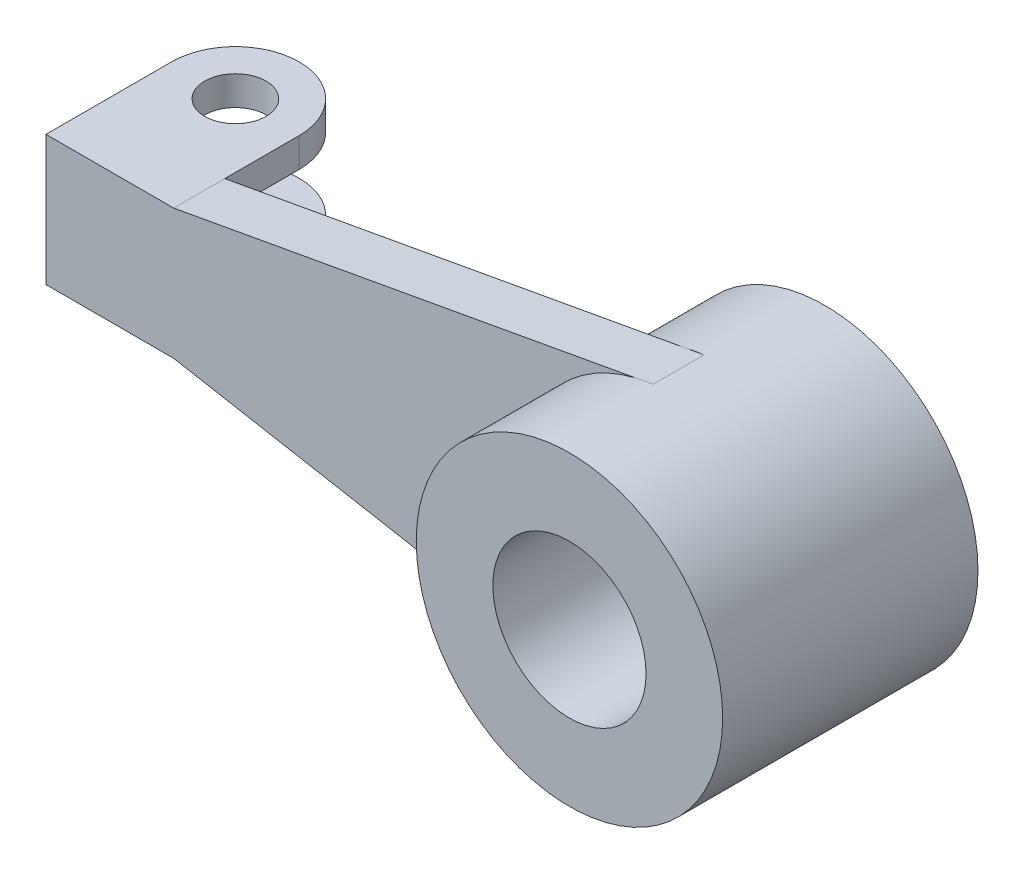
ISO-10303-21;
HEADER;
FILE_DESCRIPTION(('STEP AP214'),'2;1');
FILE_NAME('part.step','',(''),(''),'','','');
FILE_SCHEMA(('AUTOMOTIVE_DESIGN { 1 0 10303 214 1 1 1 1 }'));
ENDSEC;
DATA;
#1=APPLICATION_CONTEXT('core data for automotive mechanical design processes');
#2=APPLICATION_PROTOCOL_DEFINITION('international standard','automotive_design',2000,#1);
#3=PRODUCT_CONTEXT('',#1,'mechanical');
#4=PRODUCT('Part','Part','',(#3));
#5=PRODUCT_RELATED_PRODUCT_CATEGORY('part','',(#4));
#6=PRODUCT_DEFINITION_FORMATION('','',#4);
#7=PRODUCT_DEFINITION_CONTEXT('part definition',#1,'design');
#8=PRODUCT_DEFINITION('design','',#6,#7);
#9=PRODUCT_DEFINITION_SHAPE('','',#8);
#10=(LENGTH_UNIT() NAMED_UNIT(*) SI_UNIT(.MILLI.,.METRE.));
#11=(NAMED_UNIT(*) PLANE_ANGLE_UNIT() SI_UNIT($,.RADIAN.));
#12=(NAMED_UNIT(*) SI_UNIT($,.STERADIAN.) SOLID_ANGLE_UNIT());
#13=UNCERTAINTY_MEASURE_WITH_UNIT(LENGTH_MEASURE(1.E-05),#10,'distance_accuracy_value','');
#14=(GEOMETRIC_REPRESENTATION_CONTEXT(3) GLOBAL_UNCERTAINTY_ASSIGNED_CONTEXT((#13)) GLOBAL_UNIT_ASSIGNED_CONTEXT((#10,
#11,#12)) REPRESENTATION_CONTEXT('',''));
#15=CARTESIAN_POINT('',(0.,0.,0.));
#16=DIRECTION('',(0.,0.,1.));
#17=DIRECTION('',(1.,0.,0.));
#18=AXIS2_PLACEMENT_3D('',#15,#16,#17);
#19=CARTESIAN_POINT('',(-70.2054794520546,0.,25.));
#20=DIRECTION('',(1.,0.,0.));
#21=DIRECTION('',(0.,0.,-1.));
#22=AXIS2_PLACEMENT_3D('',#19,#20,#21);
#23=PLANE('',#22);
#24=DIRECTION('',(0.,0.,1.));
#25=VECTOR('',#24,1.);
#26=CARTESIAN_POINT('',(-70.2054794520546,70.,0.));
#27=LINE('',#26,#25);
#28=CARTESIAN_POINT('',(-70.2054794520546,70.,-220.864440970832));
#29=VERTEX_POINT('',#28);
#30=CARTESIAN_POINT('',(-70.2054794520546,70.,-75.));
#31=VERTEX_POINT('',#30);
#32=EDGE_CURVE('E157',#29,#31,#27,.T.);
#33=ORIENTED_EDGE('',*,*,#32,.T.);
#34=DIRECTION('',(0.,1.,0.));
#35=VECTOR('',#34,1.);
#36=CARTESIAN_POINT('',(-70.2054794520546,0.,-75.));
#37=LINE('',#36,#35);
#38=CARTESIAN_POINT('',(-70.2054794520546,-70.,-75.));
#39=VERTEX_POINT('',#38);
#40=EDGE_CURVE('E145',#39,#31,#37,.T.);
#41=ORIENTED_EDGE('',*,*,#40,.F.);
#42=DIRECTION('',(0.,0.,1.));
#43=VECTOR('',#42,1.);
#44=CARTESIAN_POINT('',(-70.2054794520546,-70.,0.));
#45=LINE('',#44,#43);
#46=CARTESIAN_POINT('',(-70.2054794520546,-70.,-220.864440970832));
#47=VERTEX_POINT('',#46);
#48=EDGE_CURVE('E151',#47,#39,#45,.T.);
#49=ORIENTED_EDGE('',*,*,#48,.F.);
#50=DIRECTION('',(0.,1.,0.));
#51=VECTOR('',#50,1.);
#52=CARTESIAN_POINT('',(-70.2054794520546,-126.792423142735,-220.864440970832));
#53=LINE('',#52,#51);
#54=CARTESIAN_POINT('',(-70.2054794520546,-126.792423142735,-220.864440970832));
#55=VERTEX_POINT('',#54);
#56=EDGE_CURVE('E199',#55,#47,#53,.T.);
#57=ORIENTED_EDGE('',*,*,#56,.F.);
#58=DIRECTION('',(0.,0.,-1.));
#59=VECTOR('',#58,1.);
#60=CARTESIAN_POINT('',(-70.2054794520546,-126.792423142735,0.));
#61=LINE('',#60,#59);
#62=CARTESIAN_POINT('',(-70.2054794520546,-126.792423142735,-75.));
#63=VERTEX_POINT('',#62);
#64=EDGE_CURVE('E185',#63,#55,#61,.T.);
#65=ORIENTED_EDGE('',*,*,#64,.F.);
#66=DIRECTION('',(0.,-1.,0.));
#67=VECTOR('',#66,1.);
#68=CARTESIAN_POINT('',(-70.2054794520546,0.,-75.));
#69=LINE('',#68,#67);
#70=CARTESIAN_POINT('',(-70.2054794520546,-127.397260273972,-75.));
#71=VERTEX_POINT('',#70);
#72=EDGE_CURVE('E231',#63,#71,#69,.T.);
#73=ORIENTED_EDGE('',*,*,#72,.T.);
#74=DIRECTION('',(0.,0.,-1.));
#75=VECTOR('',#74,1.);
#76=CARTESIAN_POINT('',(-70.2054794520546,-127.397260273972,25.));
#77=LINE('',#76,#75);
#78=CARTESIAN_POINT('',(-70.2054794520546,-127.397260273972,25.));
#79=VERTEX_POINT('',#78);
#80=EDGE_CURVE('E282',#79,#71,#77,.T.);
#81=ORIENTED_EDGE('',*,*,#80,.F.);
#82=DIRECTION('',(0.,-1.,0.));
#83=VECTOR('',#82,1.);
#84=CARTESIAN_POINT('',(-70.2054794520546,0.,25.));
#85=LINE('',#84,#83);
#86=CARTESIAN_POINT('',(-70.2054794520546,127.397260273972,25.));
#87=VERTEX_POINT('',#86);
#88=EDGE_CURVE('E276',#87,#79,#85,.T.);
#89=ORIENTED_EDGE('',*,*,#88,.F.);
#90=DIRECTION('',(0.,0.,-1.));
#91=VECTOR('',#90,1.);
#92=CARTESIAN_POINT('',(-70.2054794520546,127.397260273972,25.));
#93=LINE('',#92,#91);
#94=CARTESIAN_POINT('',(-70.2054794520546,127.397260273972,-220.864440970832));
#95=VERTEX_POINT('',#94);
#96=EDGE_CURVE('E284',#87,#95,#93,.T.);
#97=ORIENTED_EDGE('',*,*,#96,.T.);
#98=EDGE_CURVE('E201',#29,#95,#53,.T.);
#99=ORIENTED_EDGE('',*,*,#98,.F.);
#100=EDGE_LOOP('',(#33,#41,#49,#57,#65,#73,#81,#89,#97,#99));
#101=FACE_BOUND('',#100,.T.);
#102=ADVANCED_FACE('F35',(#101),#23,.F.);
#103=CARTESIAN_POINT('',(179.794520547945,-126.792423142735,0.));
#104=DIRECTION('',(1.,0.,0.));
#105=DIRECTION('',(0.,0.,-1.));
#106=AXIS2_PLACEMENT_3D('',#103,#104,#105);
#107=PLANE('',#106);
#108=DIRECTION('',(0.,1.,0.));
#109=VECTOR('',#108,1.);
#110=CARTESIAN_POINT('',(179.794520547945,-126.792423142735,-75.));
#111=LINE('',#110,#109);
#112=CARTESIAN_POINT('',(179.794520547945,70.,-75.));
#113=VERTEX_POINT('',#112);
#114=CARTESIAN_POINT('',(179.794520547945,127.397260273972,-75.));
#115=VERTEX_POINT('',#114);
#116=EDGE_CURVE('E198',#113,#115,#111,.T.);
#117=ORIENTED_EDGE('',*,*,#116,.F.);
#118=DIRECTION('',(0.,0.,-1.));
#119=VECTOR('',#118,1.);
#120=CARTESIAN_POINT('',(179.794520547945,70.,0.));
#121=LINE('',#120,#119);
#122=CARTESIAN_POINT('',(179.794520547945,70.,-220.864440970832));
#123=VERTEX_POINT('',#122);
#124=EDGE_CURVE('E168',#113,#123,#121,.T.);
#125=ORIENTED_EDGE('',*,*,#124,.T.);
#126=DIRECTION('',(0.,1.,0.));
#127=VECTOR('',#126,1.);
#128=CARTESIAN_POINT('',(179.794520547945,-126.792423142735,-220.864440970832));
#129=LINE('',#128,#127);
#130=CARTESIAN_POINT('',(179.794520547945,127.397260273972,-220.864440970832));
#131=VERTEX_POINT('',#130);
#132=EDGE_CURVE('E188',#123,#131,#129,.T.);
#133=ORIENTED_EDGE('',*,*,#132,.T.);
#134=DIRECTION('',(0.,0.,-1.));
#135=VECTOR('',#134,1.);
#136=CARTESIAN_POINT('',(179.794520547945,127.397260273972,0.));
#137=LINE('',#136,#135);
#138=EDGE_CURVE('E191',#115,#131,#137,.T.);
#139=ORIENTED_EDGE('',*,*,#138,.F.);
#140=EDGE_LOOP('',(#117,#125,#133,#139));
#141=FACE_BOUND('',#140,.T.);
#142=ADVANCED_FACE('F302',(#141),#107,.T.);
#143=CARTESIAN_POINT('',(54.7945205479454,-126.792423142735,-220.864440970832));
#144=DIRECTION('',(0.,1.,0.));
#145=DIRECTION('',(0.,0.,1.));
#146=AXIS2_PLACEMENT_3D('',#143,#144,#145);
#147=CYLINDRICAL_SURFACE('',#146,60.);
#148=CARTESIAN_POINT('',(54.7945205479454,127.397260273972,-220.864440970832));
#149=DIRECTION('',(0.,1.,0.));
#150=DIRECTION('',(0.,0.,1.));
#151=AXIS2_PLACEMENT_3D('',#148,#149,#150);
#152=CIRCLE('',#151,60.);
#153=CARTESIAN_POINT('',(54.7945205479454,127.397260273972,-160.864440970832));
#154=VERTEX_POINT('',#153);
#155=EDGE_CURVE('E174',#154,#154,#152,.T.);
#156=ORIENTED_EDGE('',*,*,#155,.T.);
#157=EDGE_LOOP('',(#156));
#158=FACE_BOUND('',#157,.T.);
#159=CARTESIAN_POINT('',(54.7945205479454,70.,-220.864440970832));
#160=DIRECTION('',(0.,-1.,0.));
#161=DIRECTION('',(0.,0.,-1.));
#162=AXIS2_PLACEMENT_3D('',#159,#160,#161);
#163=CIRCLE('',#162,60.);
#164=CARTESIAN_POINT('',(54.7945205479454,70.,-280.864440970832));
#165=VERTEX_POINT('',#164);
#166=EDGE_CURVE('E171',#165,#165,#163,.F.);
#167=ORIENTED_EDGE('',*,*,#166,.F.);
#168=EDGE_LOOP('',(#167));
#169=FACE_BOUND('',#168,.T.);
#170=ADVANCED_FACE('F347',(#158,#169),#147,.F.);
#171=CARTESIAN_POINT('',(54.7945205479454,-126.792423142735,-220.864440970832));
#172=DIRECTION('',(0.,1.,0.));
#173=DIRECTION('',(0.,0.,1.));
#174=AXIS2_PLACEMENT_3D('',#171,#172,#173);
#175=CYLINDRICAL_SURFACE('',#174,125.);
#176=ORIENTED_EDGE('',*,*,#132,.F.);
#177=CARTESIAN_POINT('',(54.7945205479454,70.,-220.864440970832));
#178=DIRECTION('',(0.,-1.,0.));
#179=DIRECTION('',(0.,0.,-1.));
#180=AXIS2_PLACEMENT_3D('',#177,#178,#179);
#181=CIRCLE('',#180,125.);
#182=EDGE_CURVE('E11',#123,#29,#181,.F.);
#183=ORIENTED_EDGE('',*,*,#182,.T.);
#184=ORIENTED_EDGE('',*,*,#98,.T.);
#185=CARTESIAN_POINT('',(54.7945205479454,127.397260273972,-220.864440970832));
#186=DIRECTION('',(0.,1.,0.));
#187=DIRECTION('',(0.,0.,1.));
#188=AXIS2_PLACEMENT_3D('',#185,#186,#187);
#189=CIRCLE('',#188,125.);
#190=EDGE_CURVE('E179',#131,#95,#189,.T.);
#191=ORIENTED_EDGE('',*,*,#190,.F.);
#192=EDGE_LOOP('',(#176,#183,#184,#191));
#193=FACE_BOUND('',#192,.T.);
#194=ADVANCED_FACE('F306',(#193),#175,.T.);
#195=CARTESIAN_POINT('',(0.,0.,-75.));
#196=DIRECTION('',(0.,0.,-1.));
#197=DIRECTION('',(1.,0.,0.));
#198=AXIS2_PLACEMENT_3D('',#195,#196,#197);
#199=PLANE('',#198);
#200=DIRECTION('',(-1.,0.,0.));
#201=VECTOR('',#200,1.);
#202=CARTESIAN_POINT('',(229.794520547945,70.,-75.));
#203=LINE('',#202,#201);
#204=EDGE_CURVE('E148',#113,#31,#203,.T.);
#205=ORIENTED_EDGE('',*,*,#204,.F.);
#206=ORIENTED_EDGE('',*,*,#116,.T.);
#207=DIRECTION('',(0.983919626816122,0.178611780031506,0.));
#208=VECTOR('',#207,1.);
#209=CARTESIAN_POINT('',(-16.652913148138,91.7359878907598,-75.));
#210=LINE('',#209,#208);
#211=CARTESIAN_POINT('',(1084.18392790381,291.57185084717,-75.));
#212=VERTEX_POINT('',#211);
#213=EDGE_CURVE('E230',#115,#212,#210,.T.);
#214=ORIENTED_EDGE('',*,*,#213,.T.);
#215=CARTESIAN_POINT('',(1154.79452054795,0.,-75.));
#216=DIRECTION('',(0.,0.,1.));
#217=DIRECTION('',(1.,0.,0.));
#218=AXIS2_PLACEMENT_3D('',#215,#216,#217);
#219=CIRCLE('',#218,300.);
#220=CARTESIAN_POINT('',(1084.18392790381,-291.57185084717,-75.));
#221=VERTEX_POINT('',#220);
#222=EDGE_CURVE('E217',#212,#221,#219,.T.);
#223=ORIENTED_EDGE('',*,*,#222,.T.);
#224=DIRECTION('',(0.983919626816122,-0.178611780031506,0.));
#225=VECTOR('',#224,1.);
#226=CARTESIAN_POINT('',(-16.652913148138,-91.7359878907598,-75.));
#227=LINE('',#226,#225);
#228=CARTESIAN_POINT('',(179.794520547945,-127.397260273972,-75.));
#229=VERTEX_POINT('',#228);
#230=EDGE_CURVE('E367',#229,#221,#227,.T.);
#231=ORIENTED_EDGE('',*,*,#230,.F.);
#232=DIRECTION('',(1.,0.,0.));
#233=VECTOR('',#232,1.);
#234=CARTESIAN_POINT('',(0.,-127.397260273972,-75.));
#235=LINE('',#234,#233);
#236=EDGE_CURVE('E372',#71,#229,#235,.T.);
#237=ORIENTED_EDGE('',*,*,#236,.F.);
#238=ORIENTED_EDGE('',*,*,#72,.F.);
#239=DIRECTION('',(-1.,0.,0.));
#240=VECTOR('',#239,1.);
#241=CARTESIAN_POINT('',(0.,-126.792423142735,-75.));
#242=LINE('',#241,#240);
#243=CARTESIAN_POINT('',(179.794520547945,-126.792423142735,-75.));
#244=VERTEX_POINT('',#243);
#245=EDGE_CURVE('E58',#244,#63,#242,.T.);
#246=ORIENTED_EDGE('',*,*,#245,.F.);
#247=CARTESIAN_POINT('',(179.794520547945,-70.,-75.));
#248=VERTEX_POINT('',#247);
#249=EDGE_CURVE('E147',#244,#248,#111,.T.);
#250=ORIENTED_EDGE('',*,*,#249,.T.);
#251=DIRECTION('',(-1.,0.,0.));
#252=VECTOR('',#251,1.);
#253=CARTESIAN_POINT('',(229.794520547945,-70.,-75.));
#254=LINE('',#253,#252);
#255=EDGE_CURVE('E140',#248,#39,#254,.T.);
#256=ORIENTED_EDGE('',*,*,#255,.T.);
#257=ORIENTED_EDGE('',*,*,#40,.T.);
#258=EDGE_LOOP('',(#205,#206,#214,#223,#231,#237,#238,#246,#250,#256,#257));
#259=FACE_BOUND('',#258,.T.);
#260=ADVANCED_FACE('F143',(#259),#199,.T.);
#261=CARTESIAN_POINT('',(-16.652913148138,-91.7359878907598,25.));
#262=DIRECTION('',(0.178611780031506,0.983919626816122,0.));
#263=DIRECTION('',(-0.983919626816122,0.178611780031506,0.));
#264=AXIS2_PLACEMENT_3D('',#261,#262,#263);
#265=PLANE('',#264);
#266=DIRECTION('',(0.,0.,-1.));
#267=VECTOR('',#266,1.);
#268=CARTESIAN_POINT('',(179.794520547945,-127.397260273972,25.));
#269=LINE('',#268,#267);
#270=CARTESIAN_POINT('',(179.794520547945,-127.397260273972,25.));
#271=VERTEX_POINT('',#270);
#272=EDGE_CURVE('E280',#271,#229,#269,.T.);
#273=ORIENTED_EDGE('',*,*,#272,.T.);
#274=ORIENTED_EDGE('',*,*,#230,.T.);
#275=CARTESIAN_POINT('',(1118.41838937427,-297.786462218879,-75.));
#276=VERTEX_POINT('',#275);
#277=EDGE_CURVE('E211',#221,#276,#227,.T.);
#278=ORIENTED_EDGE('',*,*,#277,.T.);
#279=DIRECTION('',(0.,0.,-1.));
#280=VECTOR('',#279,1.);
#281=CARTESIAN_POINT('',(1118.41838937427,-297.786462218879,25.));
#282=LINE('',#281,#280);
#283=CARTESIAN_POINT('',(1118.41838937427,-297.786462218879,25.));
#284=VERTEX_POINT('',#283);
#285=EDGE_CURVE('E254',#284,#276,#282,.T.);
#286=ORIENTED_EDGE('',*,*,#285,.F.);
#287=DIRECTION('',(0.983919626816122,-0.178611780031506,0.));
#288=VECTOR('',#287,1.);
#289=CARTESIAN_POINT('',(-16.652913148138,-91.7359878907598,25.));
#290=LINE('',#289,#288);
#291=CARTESIAN_POINT('',(1084.18392790381,-291.57185084717,25.));
#292=VERTEX_POINT('',#291);
#293=EDGE_CURVE('E244',#292,#284,#290,.T.);
#294=ORIENTED_EDGE('',*,*,#293,.F.);
#295=EDGE_CURVE('E268',#271,#292,#290,.T.);
#296=ORIENTED_EDGE('',*,*,#295,.F.);
#297=EDGE_LOOP('',(#273,#274,#278,#286,#294,#296));
#298=FACE_BOUND('',#297,.T.);
#299=ADVANCED_FACE('F358',(#298),#265,.F.);
#300=CARTESIAN_POINT('',(1154.79452054795,0.,25.));
#301=DIRECTION('',(0.,0.,-1.));
#302=DIRECTION('',(-1.,0.,0.));
#303=AXIS2_PLACEMENT_3D('',#300,#301,#302);
#304=CYLINDRICAL_SURFACE('',#303,300.);
#305=ORIENTED_EDGE('',*,*,#285,.T.);
#306=EDGE_CURVE('E207',#221,#276,#219,.T.);
#307=ORIENTED_EDGE('',*,*,#306,.F.);
#308=ORIENTED_EDGE('',*,*,#222,.F.);
#309=CARTESIAN_POINT('',(1118.41838937427,297.786462218879,-75.));
#310=VERTEX_POINT('',#309);
#311=EDGE_CURVE('E212',#310,#212,#219,.T.);
#312=ORIENTED_EDGE('',*,*,#311,.F.);
#313=DIRECTION('',(0.,0.,-1.));
#314=VECTOR('',#313,1.);
#315=CARTESIAN_POINT('',(1118.41838937427,297.786462218879,25.));
#316=LINE('',#315,#314);
#317=CARTESIAN_POINT('',(1118.41838937427,297.786462218879,25.));
#318=VERTEX_POINT('',#317);
#319=EDGE_CURVE('E257',#318,#310,#316,.T.);
#320=ORIENTED_EDGE('',*,*,#319,.F.);
#321=CARTESIAN_POINT('',(1154.79452054795,0.,25.));
#322=DIRECTION('',(0.,0.,1.));
#323=DIRECTION('',(1.,0.,0.));
#324=AXIS2_PLACEMENT_3D('',#321,#322,#323);
#325=CIRCLE('',#324,300.);
#326=CARTESIAN_POINT('',(1084.18392790381,291.57185084717,25.));
#327=VERTEX_POINT('',#326);
#328=EDGE_CURVE('E245',#318,#327,#325,.T.);
#329=ORIENTED_EDGE('',*,*,#328,.T.);
#330=EDGE_CURVE('E222',#327,#292,#325,.T.);
#331=ORIENTED_EDGE('',*,*,#330,.T.);
#332=EDGE_CURVE('E240',#292,#284,#325,.T.);
#333=ORIENTED_EDGE('',*,*,#332,.T.);
#334=EDGE_LOOP('',(#305,#307,#308,#312,#320,#329,#331,#333));
#335=FACE_BOUND('',#334,.T.);
#336=CARTESIAN_POINT('',(1154.79452054795,0.,225.));
#337=DIRECTION('',(0.,0.,1.));
#338=DIRECTION('',(1.,0.,0.));
#339=AXIS2_PLACEMENT_3D('',#336,#337,#338);
#340=CIRCLE('',#339,300.);
#341=CARTESIAN_POINT('',(1454.79452054795,0.,225.));
#342=VERTEX_POINT('',#341);
#343=EDGE_CURVE('E241',#342,#342,#340,.T.);
#344=ORIENTED_EDGE('',*,*,#343,.F.);
#345=EDGE_LOOP('',(#344));
#346=FACE_BOUND('',#345,.T.);
#347=CARTESIAN_POINT('',(1154.79452054795,0.,-275.));
#348=DIRECTION('',(0.,0.,1.));
#349=DIRECTION('',(1.,0.,0.));
#350=AXIS2_PLACEMENT_3D('',#347,#348,#349);
#351=CIRCLE('',#350,300.);
#352=CARTESIAN_POINT('',(1454.79452054795,0.,-275.));
#353=VERTEX_POINT('',#352);
#354=EDGE_CURVE('E208',#353,#353,#351,.T.);
#355=ORIENTED_EDGE('',*,*,#354,.T.);
#356=EDGE_LOOP('',(#355));
#357=FACE_BOUND('',#356,.T.);
#358=ADVANCED_FACE('F318',(#335,#346,#357),#304,.T.);
#359=CARTESIAN_POINT('',(-16.652913148138,91.7359878907598,25.));
#360=DIRECTION('',(-0.178611780031506,0.983919626816122,0.));
#361=DIRECTION('',(-0.983919626816122,-0.178611780031506,0.));
#362=AXIS2_PLACEMENT_3D('',#359,#360,#361);
#363=PLANE('',#362);
#364=ORIENTED_EDGE('',*,*,#319,.T.);
#365=EDGE_CURVE('E225',#212,#310,#210,.T.);
#366=ORIENTED_EDGE('',*,*,#365,.F.);
#367=ORIENTED_EDGE('',*,*,#213,.F.);
#368=DIRECTION('',(0.,0.,-1.));
#369=VECTOR('',#368,1.);
#370=CARTESIAN_POINT('',(179.794520547945,127.397260273972,25.));
#371=LINE('',#370,#369);
#372=CARTESIAN_POINT('',(179.794520547945,127.397260273972,25.));
#373=VERTEX_POINT('',#372);
#374=EDGE_CURVE('E255',#373,#115,#371,.T.);
#375=ORIENTED_EDGE('',*,*,#374,.F.);
#376=DIRECTION('',(0.983919626816122,0.178611780031506,0.));
#377=VECTOR('',#376,1.);
#378=CARTESIAN_POINT('',(-16.652913148138,91.7359878907598,25.));
#379=LINE('',#378,#377);
#380=EDGE_CURVE('E267',#373,#327,#379,.T.);
#381=ORIENTED_EDGE('',*,*,#380,.T.);
#382=EDGE_CURVE('E263',#327,#318,#379,.T.);
#383=ORIENTED_EDGE('',*,*,#382,.T.);
#384=EDGE_LOOP('',(#364,#366,#367,#375,#381,#383));
#385=FACE_BOUND('',#384,.T.);
#386=ADVANCED_FACE('F297',(#385),#363,.T.);
#387=CARTESIAN_POINT('',(0.,127.397260273972,25.));
#388=DIRECTION('',(0.,1.,0.));
#389=DIRECTION('',(0.,0.,1.));
#390=AXIS2_PLACEMENT_3D('',#387,#388,#389);
#391=PLANE('',#390);
#392=ORIENTED_EDGE('',*,*,#374,.T.);
#393=ORIENTED_EDGE('',*,*,#138,.T.);
#394=ORIENTED_EDGE('',*,*,#190,.T.);
#395=ORIENTED_EDGE('',*,*,#96,.F.);
#396=DIRECTION('',(1.,0.,0.));
#397=VECTOR('',#396,1.);
#398=CARTESIAN_POINT('',(0.,127.397260273972,25.));
#399=LINE('',#398,#397);
#400=EDGE_CURVE('E272',#87,#373,#399,.T.);
#401=ORIENTED_EDGE('',*,*,#400,.T.);
#402=EDGE_LOOP('',(#392,#393,#394,#395,#401));
#403=FACE_BOUND('',#402,.T.);
#404=ORIENTED_EDGE('',*,*,#155,.F.);
#405=EDGE_LOOP('',(#404));
#406=FACE_BOUND('',#405,.T.);
#407=ADVANCED_FACE('F290',(#403,#406),#391,.T.);
#408=CARTESIAN_POINT('',(1154.79452054795,0.,25.));
#409=DIRECTION('',(0.,0.,-1.));
#410=DIRECTION('',(-1.,0.,0.));
#411=AXIS2_PLACEMENT_3D('',#408,#409,#410);
#412=CYLINDRICAL_SURFACE('',#411,150.);
#413=CARTESIAN_POINT('',(1154.79452054795,0.,225.));
#414=DIRECTION('',(0.,0.,1.));
#415=DIRECTION('',(1.,0.,0.));
#416=AXIS2_PLACEMENT_3D('',#413,#414,#415);
#417=CIRCLE('',#416,150.);
#418=CARTESIAN_POINT('',(1304.79452054795,0.,225.));
#419=VERTEX_POINT('',#418);
#420=EDGE_CURVE('E236',#419,#419,#417,.T.);
#421=ORIENTED_EDGE('',*,*,#420,.T.);
#422=EDGE_LOOP('',(#421));
#423=FACE_BOUND('',#422,.T.);
#424=CARTESIAN_POINT('',(1154.79452054795,0.,-275.));
#425=DIRECTION('',(0.,0.,1.));
#426=DIRECTION('',(1.,0.,0.));
#427=AXIS2_PLACEMENT_3D('',#424,#425,#426);
#428=CIRCLE('',#427,150.);
#429=CARTESIAN_POINT('',(1304.79452054795,0.,-275.));
#430=VERTEX_POINT('',#429);
#431=EDGE_CURVE('E197',#430,#430,#428,.T.);
#432=ORIENTED_EDGE('',*,*,#431,.F.);
#433=EDGE_LOOP('',(#432));
#434=FACE_BOUND('',#433,.T.);
#435=ADVANCED_FACE('F37',(#423,#434),#412,.F.);
#436=CARTESIAN_POINT('',(0.,-127.397260273972,25.));
#437=DIRECTION('',(0.,1.,0.));
#438=DIRECTION('',(0.,0.,1.));
#439=AXIS2_PLACEMENT_3D('',#436,#437,#438);
#440=PLANE('',#439);
#441=ORIENTED_EDGE('',*,*,#80,.T.);
#442=ORIENTED_EDGE('',*,*,#236,.T.);
#443=ORIENTED_EDGE('',*,*,#272,.F.);
#444=DIRECTION('',(1.,0.,0.));
#445=VECTOR('',#444,1.);
#446=CARTESIAN_POINT('',(0.,-127.397260273972,25.));
#447=LINE('',#446,#445);
#448=EDGE_CURVE('E278',#79,#271,#447,.T.);
#449=ORIENTED_EDGE('',*,*,#448,.F.);
#450=EDGE_LOOP('',(#441,#442,#443,#449));
#451=FACE_BOUND('',#450,.T.);
#452=ADVANCED_FACE('F351',(#451),#440,.F.);
#453=CARTESIAN_POINT('',(0.,0.,25.));
#454=DIRECTION('',(0.,0.,1.));
#455=DIRECTION('',(1.,0.,0.));
#456=AXIS2_PLACEMENT_3D('',#453,#454,#455);
#457=PLANE('',#456);
#458=ORIENTED_EDGE('',*,*,#330,.F.);
#459=ORIENTED_EDGE('',*,*,#380,.F.);
#460=ORIENTED_EDGE('',*,*,#400,.F.);
#461=ORIENTED_EDGE('',*,*,#88,.T.);
#462=ORIENTED_EDGE('',*,*,#448,.T.);
#463=ORIENTED_EDGE('',*,*,#295,.T.);
#464=EDGE_LOOP('',(#458,#459,#460,#461,#462,#463));
#465=FACE_BOUND('',#464,.T.);
#466=ADVANCED_FACE('F310',(#465),#457,.T.);
#467=CARTESIAN_POINT('',(1154.79452054795,0.,25.));
#468=DIRECTION('',(0.,0.,1.));
#469=DIRECTION('',(1.,0.,0.));
#470=AXIS2_PLACEMENT_3D('',#467,#468,#469);
#471=PLANE('',#470);
#472=ORIENTED_EDGE('',*,*,#332,.F.);
#473=ORIENTED_EDGE('',*,*,#293,.T.);
#474=EDGE_LOOP('',(#472,#473));
#475=FACE_BOUND('',#474,.T.);
#476=ADVANCED_FACE('F336',(#475),#471,.F.);
#477=CARTESIAN_POINT('',(1154.79452054795,0.,225.));
#478=DIRECTION('',(0.,0.,1.));
#479=DIRECTION('',(1.,0.,0.));
#480=AXIS2_PLACEMENT_3D('',#477,#478,#479);
#481=PLANE('',#480);
#482=ORIENTED_EDGE('',*,*,#343,.T.);
#483=EDGE_LOOP('',(#482));
#484=FACE_BOUND('',#483,.T.);
#485=ORIENTED_EDGE('',*,*,#420,.F.);
#486=EDGE_LOOP('',(#485));
#487=FACE_BOUND('',#486,.T.);
#488=ADVANCED_FACE('F334',(#484,#487),#481,.T.);
#489=ORIENTED_EDGE('',*,*,#382,.F.);
#490=ORIENTED_EDGE('',*,*,#328,.F.);
#491=EDGE_LOOP('',(#489,#490));
#492=FACE_BOUND('',#491,.T.);
#493=ADVANCED_FACE('F315',(#492),#471,.F.);
#494=CARTESIAN_POINT('',(1154.79452054795,0.,-75.));
#495=DIRECTION('',(0.,0.,-1.));
#496=DIRECTION('',(1.,0.,0.));
#497=AXIS2_PLACEMENT_3D('',#494,#495,#496);
#498=PLANE('',#497);
#499=ORIENTED_EDGE('',*,*,#311,.T.);
#500=ORIENTED_EDGE('',*,*,#365,.T.);
#501=EDGE_LOOP('',(#499,#500));
#502=FACE_BOUND('',#501,.T.);
#503=ADVANCED_FACE('F323',(#502),#498,.F.);
#504=CARTESIAN_POINT('',(1154.79452054795,0.,-275.));
#505=DIRECTION('',(0.,0.,-1.));
#506=DIRECTION('',(1.,0.,0.));
#507=AXIS2_PLACEMENT_3D('',#504,#505,#506);
#508=PLANE('',#507);
#509=ORIENTED_EDGE('',*,*,#431,.T.);
#510=EDGE_LOOP('',(#509));
#511=FACE_BOUND('',#510,.T.);
#512=ORIENTED_EDGE('',*,*,#354,.F.);
#513=EDGE_LOOP('',(#512));
#514=FACE_BOUND('',#513,.T.);
#515=ADVANCED_FACE('F325',(#511,#514),#508,.T.);
#516=ORIENTED_EDGE('',*,*,#277,.F.);
#517=ORIENTED_EDGE('',*,*,#306,.T.);
#518=EDGE_LOOP('',(#516,#517));
#519=FACE_BOUND('',#518,.T.);
#520=ADVANCED_FACE('F327',(#519),#498,.F.);
#521=DIRECTION('',(0.,0.,-1.));
#522=VECTOR('',#521,1.);
#523=CARTESIAN_POINT('',(179.794520547945,-70.,0.));
#524=LINE('',#523,#522);
#525=CARTESIAN_POINT('',(179.794520547945,-70.,-220.864440970832));
#526=VERTEX_POINT('',#525);
#527=EDGE_CURVE('E50',#248,#526,#524,.T.);
#528=ORIENTED_EDGE('',*,*,#527,.F.);
#529=ORIENTED_EDGE('',*,*,#249,.F.);
#530=DIRECTION('',(0.,0.,-1.));
#531=VECTOR('',#530,1.);
#532=CARTESIAN_POINT('',(179.794520547945,-126.792423142735,0.));
#533=LINE('',#532,#531);
#534=CARTESIAN_POINT('',(179.794520547945,-126.792423142735,-220.864440970832));
#535=VERTEX_POINT('',#534);
#536=EDGE_CURVE('E178',#244,#535,#533,.T.);
#537=ORIENTED_EDGE('',*,*,#536,.T.);
#538=EDGE_CURVE('E202',#535,#526,#129,.T.);
#539=ORIENTED_EDGE('',*,*,#538,.T.);
#540=EDGE_LOOP('',(#528,#529,#537,#539));
#541=FACE_BOUND('',#540,.T.);
#542=ADVANCED_FACE('F339',(#541),#107,.T.);
#543=CARTESIAN_POINT('',(54.7945205479454,-70.,-220.864440970832));
#544=DIRECTION('',(0.,-1.,0.));
#545=DIRECTION('',(0.,0.,-1.));
#546=AXIS2_PLACEMENT_3D('',#543,#544,#545);
#547=CIRCLE('',#546,60.);
#548=CARTESIAN_POINT('',(54.7945205479454,-70.,-280.864440970832));
#549=VERTEX_POINT('',#548);
#550=EDGE_CURVE('E165',#549,#549,#547,.F.);
#551=ORIENTED_EDGE('',*,*,#550,.T.);
#552=EDGE_LOOP('',(#551));
#553=FACE_BOUND('',#552,.T.);
#554=CARTESIAN_POINT('',(54.7945205479454,-126.792423142735,-220.864440970832));
#555=DIRECTION('',(0.,1.,0.));
#556=DIRECTION('',(0.,0.,1.));
#557=AXIS2_PLACEMENT_3D('',#554,#555,#556);
#558=CIRCLE('',#557,60.);
#559=CARTESIAN_POINT('',(54.7945205479454,-126.792423142735,-160.864440970832));
#560=VERTEX_POINT('',#559);
#561=EDGE_CURVE('E175',#560,#560,#558,.T.);
#562=ORIENTED_EDGE('',*,*,#561,.F.);
#563=EDGE_LOOP('',(#562));
#564=FACE_BOUND('',#563,.T.);
#565=ADVANCED_FACE('F380',(#553,#564),#147,.F.);
#566=CARTESIAN_POINT('',(54.7945205479454,-70.,-220.864440970832));
#567=DIRECTION('',(0.,-1.,0.));
#568=DIRECTION('',(0.,0.,-1.));
#569=AXIS2_PLACEMENT_3D('',#566,#567,#568);
#570=CIRCLE('',#569,125.);
#571=EDGE_CURVE('E43',#526,#47,#570,.F.);
#572=ORIENTED_EDGE('',*,*,#571,.F.);
#573=ORIENTED_EDGE('',*,*,#538,.F.);
#574=CARTESIAN_POINT('',(54.7945205479454,-126.792423142735,-220.864440970832));
#575=DIRECTION('',(0.,1.,0.));
#576=DIRECTION('',(0.,0.,1.));
#577=AXIS2_PLACEMENT_3D('',#574,#575,#576);
#578=CIRCLE('',#577,125.);
#579=EDGE_CURVE('E182',#535,#55,#578,.T.);
#580=ORIENTED_EDGE('',*,*,#579,.T.);
#581=ORIENTED_EDGE('',*,*,#56,.T.);
#582=EDGE_LOOP('',(#572,#573,#580,#581));
#583=FACE_BOUND('',#582,.T.);
#584=ADVANCED_FACE('F378',(#583),#175,.T.);
#585=CARTESIAN_POINT('',(0.,-126.792423142735,0.));
#586=DIRECTION('',(0.,1.,0.));
#587=DIRECTION('',(0.,0.,1.));
#588=AXIS2_PLACEMENT_3D('',#585,#586,#587);
#589=PLANE('',#588);
#590=ORIENTED_EDGE('',*,*,#561,.T.);
#591=EDGE_LOOP('',(#590));
#592=FACE_BOUND('',#591,.T.);
#593=ORIENTED_EDGE('',*,*,#536,.F.);
#594=ORIENTED_EDGE('',*,*,#245,.T.);
#595=ORIENTED_EDGE('',*,*,#64,.T.);
#596=ORIENTED_EDGE('',*,*,#579,.F.);
#597=EDGE_LOOP('',(#593,#594,#595,#596));
#598=FACE_BOUND('',#597,.T.);
#599=ADVANCED_FACE('F375',(#592,#598),#589,.F.);
#600=CARTESIAN_POINT('',(229.794520547945,70.,0.));
#601=DIRECTION('',(0.,-1.,0.));
#602=DIRECTION('',(0.,0.,-1.));
#603=AXIS2_PLACEMENT_3D('',#600,#601,#602);
#604=PLANE('',#603);
#605=ORIENTED_EDGE('',*,*,#204,.T.);
#606=ORIENTED_EDGE('',*,*,#32,.F.);
#607=ORIENTED_EDGE('',*,*,#182,.F.);
#608=ORIENTED_EDGE('',*,*,#124,.F.);
#609=EDGE_LOOP('',(#605,#606,#607,#608));
#610=FACE_BOUND('',#609,.T.);
#611=ORIENTED_EDGE('',*,*,#166,.T.);
#612=EDGE_LOOP('',(#611));
#613=FACE_BOUND('',#612,.T.);
#614=ADVANCED_FACE('F387',(#610,#613),#604,.T.);
#615=CARTESIAN_POINT('',(229.794520547945,-70.,0.));
#616=DIRECTION('',(0.,-1.,0.));
#617=DIRECTION('',(0.,0.,-1.));
#618=AXIS2_PLACEMENT_3D('',#615,#616,#617);
#619=PLANE('',#618);
#620=ORIENTED_EDGE('',*,*,#527,.T.);
#621=ORIENTED_EDGE('',*,*,#571,.T.);
#622=ORIENTED_EDGE('',*,*,#48,.T.);
#623=ORIENTED_EDGE('',*,*,#255,.F.);
#624=EDGE_LOOP('',(#620,#621,#622,#623));
#625=FACE_BOUND('',#624,.T.);
#626=ORIENTED_EDGE('',*,*,#550,.F.);
#627=EDGE_LOOP('',(#626));
#628=FACE_BOUND('',#627,.T.);
#629=ADVANCED_FACE('F152',(#625,#628),#619,.F.);
#630=CLOSED_SHELL('',(#102,#142,#170,#194,#260,#299,#358,#386,#407,#435,#452,#466,#476,#488,
#493,#503,#515,#520,#542,#565,#584,#599,#614,#629));
#631=MANIFOLD_SOLID_BREP('B2',#630);
#632=ADVANCED_BREP_SHAPE_REPRESENTATION('',(#18,#631),#14);
#633=SHAPE_DEFINITION_REPRESENTATION(#9,#632);
ENDSEC;
END-ISO-10303-21;
